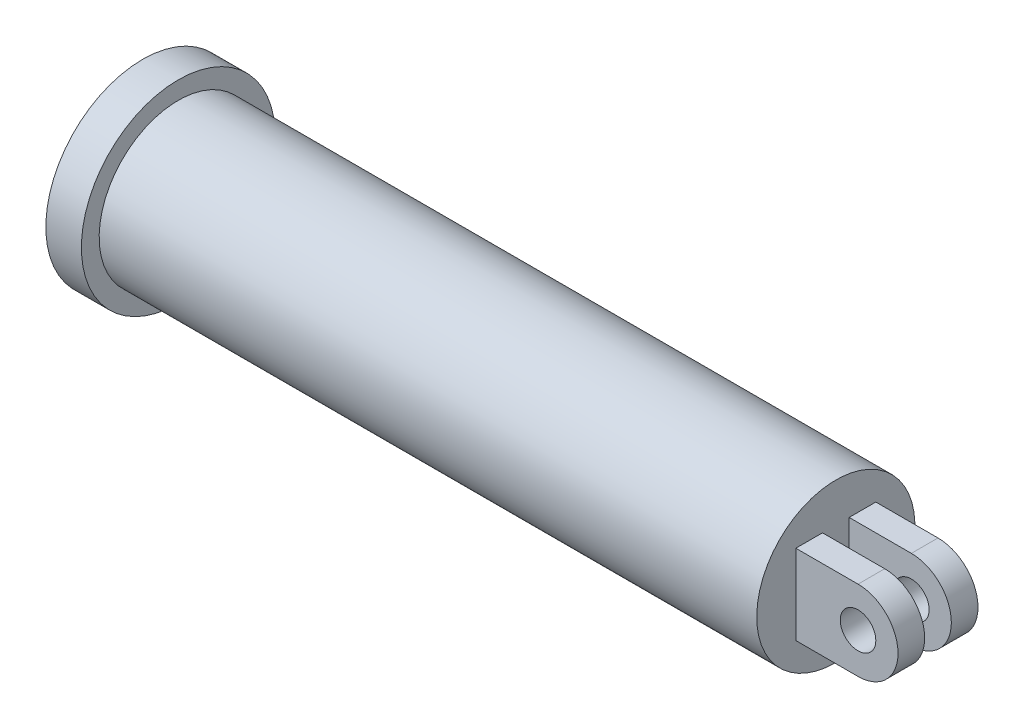
ISO-10303-21;
HEADER;
FILE_DESCRIPTION(('STEP AP214'),'2;1');
FILE_NAME('part.step','',(''),(''),'','','');
FILE_SCHEMA(('AUTOMOTIVE_DESIGN { 1 0 10303 214 1 1 1 1 }'));
ENDSEC;
DATA;
#1=APPLICATION_CONTEXT('core data for automotive mechanical design processes');
#2=APPLICATION_PROTOCOL_DEFINITION('international standard','automotive_design',2000,#1);
#3=PRODUCT_CONTEXT('',#1,'mechanical');
#4=PRODUCT('Part','Part','',(#3));
#5=PRODUCT_RELATED_PRODUCT_CATEGORY('part','',(#4));
#6=PRODUCT_DEFINITION_FORMATION('','',#4);
#7=PRODUCT_DEFINITION_CONTEXT('part definition',#1,'design');
#8=PRODUCT_DEFINITION('design','',#6,#7);
#9=PRODUCT_DEFINITION_SHAPE('','',#8);
#10=(LENGTH_UNIT() NAMED_UNIT(*) SI_UNIT(.MILLI.,.METRE.));
#11=(NAMED_UNIT(*) PLANE_ANGLE_UNIT() SI_UNIT($,.RADIAN.));
#12=(NAMED_UNIT(*) SI_UNIT($,.STERADIAN.) SOLID_ANGLE_UNIT());
#13=UNCERTAINTY_MEASURE_WITH_UNIT(LENGTH_MEASURE(1.E-05),#10,'distance_accuracy_value','');
#14=(GEOMETRIC_REPRESENTATION_CONTEXT(3) GLOBAL_UNCERTAINTY_ASSIGNED_CONTEXT((#13)) GLOBAL_UNIT_ASSIGNED_CONTEXT((#10,
#11,#12)) REPRESENTATION_CONTEXT('',''));
#15=CARTESIAN_POINT('',(0.,0.,0.));
#16=DIRECTION('',(0.,0.,1.));
#17=DIRECTION('',(1.,0.,0.));
#18=AXIS2_PLACEMENT_3D('',#15,#16,#17);
#19=CARTESIAN_POINT('',(195.,0.,0.));
#20=DIRECTION('',(-1.,0.,0.));
#21=DIRECTION('',(0.,-1.,0.));
#22=AXIS2_PLACEMENT_3D('',#19,#20,#21);
#23=PLANE('',#22);
#24=DIRECTION('',(0.,0.,-1.));
#25=VECTOR('',#24,1.);
#26=CARTESIAN_POINT('',(195.,-22.5,22.5));
#27=LINE('',#26,#25);
#28=CARTESIAN_POINT('',(195.,-22.5,22.5));
#29=VERTEX_POINT('',#28);
#30=CARTESIAN_POINT('',(195.,-22.5,7.5));
#31=VERTEX_POINT('',#30);
#32=EDGE_CURVE('E55',#29,#31,#27,.T.);
#33=ORIENTED_EDGE('',*,*,#32,.F.);
#34=DIRECTION('',(0.,-1.,0.));
#35=VECTOR('',#34,1.);
#36=CARTESIAN_POINT('',(195.,22.5,22.5));
#37=LINE('',#36,#35);
#38=CARTESIAN_POINT('',(195.,22.5,22.5));
#39=VERTEX_POINT('',#38);
#40=EDGE_CURVE('E132',#39,#29,#37,.T.);
#41=ORIENTED_EDGE('',*,*,#40,.F.);
#42=DIRECTION('',(0.,0.,-1.));
#43=VECTOR('',#42,1.);
#44=CARTESIAN_POINT('',(195.,22.5,22.5));
#45=LINE('',#44,#43);
#46=CARTESIAN_POINT('',(195.,22.5,7.5));
#47=VERTEX_POINT('',#46);
#48=EDGE_CURVE('E143',#39,#47,#45,.T.);
#49=ORIENTED_EDGE('',*,*,#48,.T.);
#50=DIRECTION('',(0.,-1.,0.));
#51=VECTOR('',#50,1.);
#52=CARTESIAN_POINT('',(195.,22.5,7.5));
#53=LINE('',#52,#51);
#54=EDGE_CURVE('E130',#47,#31,#53,.T.);
#55=ORIENTED_EDGE('',*,*,#54,.T.);
#56=EDGE_LOOP('',(#33,#41,#49,#55));
#57=FACE_BOUND('',#56,.T.);
#58=CARTESIAN_POINT('',(195.,0.,0.));
#59=DIRECTION('',(-1.,0.,0.));
#60=DIRECTION('',(0.,-1.,0.));
#61=AXIS2_PLACEMENT_3D('',#58,#59,#60);
#62=CIRCLE('',#61,44.4999999999999);
#63=CARTESIAN_POINT('',(195.,-44.4999999999999,0.));
#64=VERTEX_POINT('',#63);
#65=EDGE_CURVE('E11',#64,#64,#62,.T.);
#66=ORIENTED_EDGE('',*,*,#65,.F.);
#67=EDGE_LOOP('',(#66));
#68=FACE_BOUND('',#67,.T.);
#69=DIRECTION('',(0.,-1.,0.));
#70=VECTOR('',#69,1.);
#71=CARTESIAN_POINT('',(195.,22.5,-22.5));
#72=LINE('',#71,#70);
#73=CARTESIAN_POINT('',(195.,22.5,-22.5));
#74=VERTEX_POINT('',#73);
#75=CARTESIAN_POINT('',(195.,-22.5,-22.5));
#76=VERTEX_POINT('',#75);
#77=EDGE_CURVE('E99',#74,#76,#72,.T.);
#78=ORIENTED_EDGE('',*,*,#77,.T.);
#79=DIRECTION('',(0.,0.,1.));
#80=VECTOR('',#79,1.);
#81=CARTESIAN_POINT('',(195.,-22.5,-22.5));
#82=LINE('',#81,#80);
#83=CARTESIAN_POINT('',(195.,-22.5,-7.5));
#84=VERTEX_POINT('',#83);
#85=EDGE_CURVE('E246',#76,#84,#82,.T.);
#86=ORIENTED_EDGE('',*,*,#85,.T.);
#87=DIRECTION('',(0.,-1.,0.));
#88=VECTOR('',#87,1.);
#89=CARTESIAN_POINT('',(195.,22.5,-7.5));
#90=LINE('',#89,#88);
#91=CARTESIAN_POINT('',(195.,22.5,-7.5));
#92=VERTEX_POINT('',#91);
#93=EDGE_CURVE('E119',#92,#84,#90,.T.);
#94=ORIENTED_EDGE('',*,*,#93,.F.);
#95=DIRECTION('',(0.,0.,1.));
#96=VECTOR('',#95,1.);
#97=CARTESIAN_POINT('',(195.,22.5,-22.5));
#98=LINE('',#97,#96);
#99=EDGE_CURVE('E114',#74,#92,#98,.T.);
#100=ORIENTED_EDGE('',*,*,#99,.F.);
#101=EDGE_LOOP('',(#78,#86,#94,#100));
#102=FACE_BOUND('',#101,.T.);
#103=ADVANCED_FACE('F32',(#57,#68,#102),#23,.F.);
#104=CARTESIAN_POINT('',(-195.,54.5,0.));
#105=DIRECTION('',(1.,0.,0.));
#106=DIRECTION('',(0.,1.,0.));
#107=AXIS2_PLACEMENT_3D('',#104,#105,#106);
#108=PLANE('',#107);
#109=CARTESIAN_POINT('',(-195.,0.,0.));
#110=DIRECTION('',(-1.,0.,0.));
#111=DIRECTION('',(0.,-1.,0.));
#112=AXIS2_PLACEMENT_3D('',#109,#110,#111);
#113=CIRCLE('',#112,54.5);
#114=CARTESIAN_POINT('',(-195.,-54.5,0.));
#115=VERTEX_POINT('',#114);
#116=EDGE_CURVE('E159',#115,#115,#113,.T.);
#117=ORIENTED_EDGE('',*,*,#116,.T.);
#118=EDGE_LOOP('',(#117));
#119=FACE_BOUND('',#118,.T.);
#120=ADVANCED_FACE('F34',(#119),#108,.F.);
#121=CARTESIAN_POINT('',(-195.,0.,0.));
#122=DIRECTION('',(-1.,0.,0.));
#123=DIRECTION('',(0.,-1.,0.));
#124=AXIS2_PLACEMENT_3D('',#121,#122,#123);
#125=CYLINDRICAL_SURFACE('',#124,44.4999999999999);
#126=CARTESIAN_POINT('',(-175.,0.,0.));
#127=DIRECTION('',(-1.,0.,0.));
#128=DIRECTION('',(0.,-1.,0.));
#129=AXIS2_PLACEMENT_3D('',#126,#127,#128);
#130=CIRCLE('',#129,44.5);
#131=CARTESIAN_POINT('',(-175.,-44.4999999999999,0.));
#132=VERTEX_POINT('',#131);
#133=EDGE_CURVE('E40',#132,#132,#130,.T.);
#134=ORIENTED_EDGE('',*,*,#133,.F.);
#135=EDGE_LOOP('',(#134));
#136=FACE_BOUND('',#135,.T.);
#137=ORIENTED_EDGE('',*,*,#65,.T.);
#138=EDGE_LOOP('',(#137));
#139=FACE_BOUND('',#138,.T.);
#140=ADVANCED_FACE('F169',(#136,#139),#125,.T.);
#141=CARTESIAN_POINT('',(-175.,44.5,0.));
#142=DIRECTION('',(-1.,0.,0.));
#143=DIRECTION('',(0.,-1.,0.));
#144=AXIS2_PLACEMENT_3D('',#141,#142,#143);
#145=PLANE('',#144);
#146=CARTESIAN_POINT('',(-175.,0.,0.));
#147=DIRECTION('',(-1.,0.,0.));
#148=DIRECTION('',(0.,-1.,0.));
#149=AXIS2_PLACEMENT_3D('',#146,#147,#148);
#150=CIRCLE('',#149,54.5);
#151=CARTESIAN_POINT('',(-175.,-54.5,0.));
#152=VERTEX_POINT('',#151);
#153=EDGE_CURVE('E162',#152,#152,#150,.T.);
#154=ORIENTED_EDGE('',*,*,#153,.F.);
#155=EDGE_LOOP('',(#154));
#156=FACE_BOUND('',#155,.T.);
#157=ORIENTED_EDGE('',*,*,#133,.T.);
#158=EDGE_LOOP('',(#157));
#159=FACE_BOUND('',#158,.T.);
#160=ADVANCED_FACE('F167',(#156,#159),#145,.F.);
#161=CARTESIAN_POINT('',(-195.,0.,0.));
#162=DIRECTION('',(-1.,0.,0.));
#163=DIRECTION('',(0.,-1.,0.));
#164=AXIS2_PLACEMENT_3D('',#161,#162,#163);
#165=CYLINDRICAL_SURFACE('',#164,54.5);
#166=ORIENTED_EDGE('',*,*,#116,.F.);
#167=EDGE_LOOP('',(#166));
#168=FACE_BOUND('',#167,.T.);
#169=ORIENTED_EDGE('',*,*,#153,.T.);
#170=EDGE_LOOP('',(#169));
#171=FACE_BOUND('',#170,.T.);
#172=ADVANCED_FACE('F183',(#168,#171),#165,.T.);
#173=CARTESIAN_POINT('',(230.,0.,22.5));
#174=DIRECTION('',(0.,0.,-1.));
#175=DIRECTION('',(-1.,0.,0.));
#176=AXIS2_PLACEMENT_3D('',#173,#174,#175);
#177=PLANE('',#176);
#178=ORIENTED_EDGE('',*,*,#40,.T.);
#179=DIRECTION('',(1.,0.,0.));
#180=VECTOR('',#179,1.);
#181=CARTESIAN_POINT('',(195.,-22.5,22.5));
#182=LINE('',#181,#180);
#183=CARTESIAN_POINT('',(230.,-22.5,22.5));
#184=VERTEX_POINT('',#183);
#185=EDGE_CURVE('E135',#29,#184,#182,.T.);
#186=ORIENTED_EDGE('',*,*,#185,.T.);
#187=CARTESIAN_POINT('',(230.,0.,22.5));
#188=DIRECTION('',(0.,0.,1.));
#189=DIRECTION('',(-1.,0.,0.));
#190=AXIS2_PLACEMENT_3D('',#187,#188,#189);
#191=CIRCLE('',#190,22.5);
#192=CARTESIAN_POINT('',(230.,22.5,22.5));
#193=VERTEX_POINT('',#192);
#194=EDGE_CURVE('E138',#184,#193,#191,.T.);
#195=ORIENTED_EDGE('',*,*,#194,.T.);
#196=DIRECTION('',(-1.,0.,0.));
#197=VECTOR('',#196,1.);
#198=CARTESIAN_POINT('',(195.,22.5,22.5));
#199=LINE('',#198,#197);
#200=EDGE_CURVE('E140',#193,#39,#199,.T.);
#201=ORIENTED_EDGE('',*,*,#200,.T.);
#202=EDGE_LOOP('',(#178,#186,#195,#201));
#203=FACE_BOUND('',#202,.T.);
#204=CARTESIAN_POINT('',(230.,0.,22.5));
#205=DIRECTION('',(0.,0.,1.));
#206=DIRECTION('',(1.,0.,0.));
#207=AXIS2_PLACEMENT_3D('',#204,#205,#206);
#208=CIRCLE('',#207,10.);
#209=CARTESIAN_POINT('',(240.,0.,22.5));
#210=VERTEX_POINT('',#209);
#211=EDGE_CURVE('E123',#210,#210,#208,.T.);
#212=ORIENTED_EDGE('',*,*,#211,.F.);
#213=EDGE_LOOP('',(#212));
#214=FACE_BOUND('',#213,.T.);
#215=ADVANCED_FACE('F187',(#203,#214),#177,.F.);
#216=CARTESIAN_POINT('',(230.,0.,7.5));
#217=DIRECTION('',(0.,0.,-1.));
#218=DIRECTION('',(-1.,0.,0.));
#219=AXIS2_PLACEMENT_3D('',#216,#217,#218);
#220=PLANE('',#219);
#221=ORIENTED_EDGE('',*,*,#54,.F.);
#222=DIRECTION('',(-1.,0.,0.));
#223=VECTOR('',#222,1.);
#224=CARTESIAN_POINT('',(195.,22.5,7.5));
#225=LINE('',#224,#223);
#226=CARTESIAN_POINT('',(230.,22.5,7.5));
#227=VERTEX_POINT('',#226);
#228=EDGE_CURVE('E136',#227,#47,#225,.T.);
#229=ORIENTED_EDGE('',*,*,#228,.F.);
#230=CARTESIAN_POINT('',(230.,0.,7.5));
#231=DIRECTION('',(0.,0.,1.));
#232=DIRECTION('',(-1.,0.,0.));
#233=AXIS2_PLACEMENT_3D('',#230,#231,#232);
#234=CIRCLE('',#233,22.5);
#235=CARTESIAN_POINT('',(230.,-22.5,7.5));
#236=VERTEX_POINT('',#235);
#237=EDGE_CURVE('E147',#236,#227,#234,.T.);
#238=ORIENTED_EDGE('',*,*,#237,.F.);
#239=DIRECTION('',(1.,0.,0.));
#240=VECTOR('',#239,1.);
#241=CARTESIAN_POINT('',(195.,-22.5,7.5));
#242=LINE('',#241,#240);
#243=EDGE_CURVE('E145',#31,#236,#242,.T.);
#244=ORIENTED_EDGE('',*,*,#243,.F.);
#245=EDGE_LOOP('',(#221,#229,#238,#244));
#246=FACE_BOUND('',#245,.T.);
#247=CARTESIAN_POINT('',(230.,0.,7.5));
#248=DIRECTION('',(0.,0.,1.));
#249=DIRECTION('',(1.,0.,0.));
#250=AXIS2_PLACEMENT_3D('',#247,#248,#249);
#251=CIRCLE('',#250,10.);
#252=CARTESIAN_POINT('',(240.,0.,7.5));
#253=VERTEX_POINT('',#252);
#254=EDGE_CURVE('E120',#253,#253,#251,.T.);
#255=ORIENTED_EDGE('',*,*,#254,.T.);
#256=EDGE_LOOP('',(#255));
#257=FACE_BOUND('',#256,.T.);
#258=ADVANCED_FACE('F193',(#246,#257),#220,.T.);
#259=CARTESIAN_POINT('',(195.,-22.5,22.5));
#260=DIRECTION('',(0.,1.,0.));
#261=DIRECTION('',(-1.,0.,0.));
#262=AXIS2_PLACEMENT_3D('',#259,#260,#261);
#263=PLANE('',#262);
#264=ORIENTED_EDGE('',*,*,#243,.T.);
#265=DIRECTION('',(0.,0.,-1.));
#266=VECTOR('',#265,1.);
#267=CARTESIAN_POINT('',(230.,-22.5,22.5));
#268=LINE('',#267,#266);
#269=EDGE_CURVE('E155',#184,#236,#268,.T.);
#270=ORIENTED_EDGE('',*,*,#269,.F.);
#271=ORIENTED_EDGE('',*,*,#185,.F.);
#272=ORIENTED_EDGE('',*,*,#32,.T.);
#273=EDGE_LOOP('',(#264,#270,#271,#272));
#274=FACE_BOUND('',#273,.T.);
#275=ADVANCED_FACE('F189',(#274),#263,.F.);
#276=CARTESIAN_POINT('',(230.,0.,22.5));
#277=DIRECTION('',(0.,0.,-1.));
#278=DIRECTION('',(-1.,0.,0.));
#279=AXIS2_PLACEMENT_3D('',#276,#277,#278);
#280=CYLINDRICAL_SURFACE('',#279,22.5);
#281=ORIENTED_EDGE('',*,*,#237,.T.);
#282=DIRECTION('',(0.,0.,-1.));
#283=VECTOR('',#282,1.);
#284=CARTESIAN_POINT('',(230.,22.5,22.5));
#285=LINE('',#284,#283);
#286=EDGE_CURVE('E152',#193,#227,#285,.T.);
#287=ORIENTED_EDGE('',*,*,#286,.F.);
#288=ORIENTED_EDGE('',*,*,#194,.F.);
#289=ORIENTED_EDGE('',*,*,#269,.T.);
#290=EDGE_LOOP('',(#281,#287,#288,#289));
#291=FACE_BOUND('',#290,.T.);
#292=ADVANCED_FACE('F192',(#291),#280,.T.);
#293=CARTESIAN_POINT('',(195.,22.5,22.5));
#294=DIRECTION('',(0.,-1.,0.));
#295=DIRECTION('',(1.,0.,0.));
#296=AXIS2_PLACEMENT_3D('',#293,#294,#295);
#297=PLANE('',#296);
#298=ORIENTED_EDGE('',*,*,#228,.T.);
#299=ORIENTED_EDGE('',*,*,#48,.F.);
#300=ORIENTED_EDGE('',*,*,#200,.F.);
#301=ORIENTED_EDGE('',*,*,#286,.T.);
#302=EDGE_LOOP('',(#298,#299,#300,#301));
#303=FACE_BOUND('',#302,.T.);
#304=ADVANCED_FACE('F197',(#303),#297,.F.);
#305=CARTESIAN_POINT('',(230.,0.,22.5));
#306=DIRECTION('',(0.,0.,-1.));
#307=DIRECTION('',(-1.,0.,0.));
#308=AXIS2_PLACEMENT_3D('',#305,#306,#307);
#309=CYLINDRICAL_SURFACE('',#308,10.);
#310=ORIENTED_EDGE('',*,*,#211,.T.);
#311=EDGE_LOOP('',(#310));
#312=FACE_BOUND('',#311,.T.);
#313=ORIENTED_EDGE('',*,*,#254,.F.);
#314=EDGE_LOOP('',(#313));
#315=FACE_BOUND('',#314,.T.);
#316=ADVANCED_FACE('F201',(#312,#315),#309,.F.);
#317=CARTESIAN_POINT('',(195.,22.5,-22.5));
#318=DIRECTION('',(0.,1.,0.));
#319=DIRECTION('',(-1.,0.,0.));
#320=AXIS2_PLACEMENT_3D('',#317,#318,#319);
#321=PLANE('',#320);
#322=DIRECTION('',(-1.,0.,0.));
#323=VECTOR('',#322,1.);
#324=CARTESIAN_POINT('',(195.,22.5,-7.5));
#325=LINE('',#324,#323);
#326=CARTESIAN_POINT('',(230.,22.5,-7.5));
#327=VERTEX_POINT('',#326);
#328=EDGE_CURVE('E47',#327,#92,#325,.T.);
#329=ORIENTED_EDGE('',*,*,#328,.F.);
#330=DIRECTION('',(0.,0.,1.));
#331=VECTOR('',#330,1.);
#332=CARTESIAN_POINT('',(230.,22.5,-22.5));
#333=LINE('',#332,#331);
#334=CARTESIAN_POINT('',(230.,22.5,-22.5));
#335=VERTEX_POINT('',#334);
#336=EDGE_CURVE('E116',#335,#327,#333,.T.);
#337=ORIENTED_EDGE('',*,*,#336,.F.);
#338=DIRECTION('',(-1.,0.,0.));
#339=VECTOR('',#338,1.);
#340=CARTESIAN_POINT('',(195.,22.5,-22.5));
#341=LINE('',#340,#339);
#342=EDGE_CURVE('E103',#335,#74,#341,.T.);
#343=ORIENTED_EDGE('',*,*,#342,.T.);
#344=ORIENTED_EDGE('',*,*,#99,.T.);
#345=EDGE_LOOP('',(#329,#337,#343,#344));
#346=FACE_BOUND('',#345,.T.);
#347=ADVANCED_FACE('F113',(#346),#321,.T.);
#348=CARTESIAN_POINT('',(230.,0.,-22.5));
#349=DIRECTION('',(0.,0.,1.));
#350=DIRECTION('',(1.,0.,0.));
#351=AXIS2_PLACEMENT_3D('',#348,#349,#350);
#352=CYLINDRICAL_SURFACE('',#351,22.5);
#353=CARTESIAN_POINT('',(230.,0.,-7.5));
#354=DIRECTION('',(0.,0.,1.));
#355=DIRECTION('',(-1.,0.,0.));
#356=AXIS2_PLACEMENT_3D('',#353,#354,#355);
#357=CIRCLE('',#356,22.5);
#358=CARTESIAN_POINT('',(230.,-22.5,-7.5));
#359=VERTEX_POINT('',#358);
#360=EDGE_CURVE('E249',#359,#327,#357,.T.);
#361=ORIENTED_EDGE('',*,*,#360,.F.);
#362=DIRECTION('',(0.,0.,1.));
#363=VECTOR('',#362,1.);
#364=CARTESIAN_POINT('',(230.,-22.5,-22.5));
#365=LINE('',#364,#363);
#366=CARTESIAN_POINT('',(230.,-22.5,-22.5));
#367=VERTEX_POINT('',#366);
#368=EDGE_CURVE('E125',#367,#359,#365,.T.);
#369=ORIENTED_EDGE('',*,*,#368,.F.);
#370=CARTESIAN_POINT('',(230.,0.,-22.5));
#371=DIRECTION('',(0.,0.,1.));
#372=DIRECTION('',(-1.,0.,0.));
#373=AXIS2_PLACEMENT_3D('',#370,#371,#372);
#374=CIRCLE('',#373,22.5);
#375=EDGE_CURVE('E117',#367,#335,#374,.T.);
#376=ORIENTED_EDGE('',*,*,#375,.T.);
#377=ORIENTED_EDGE('',*,*,#336,.T.);
#378=EDGE_LOOP('',(#361,#369,#376,#377));
#379=FACE_BOUND('',#378,.T.);
#380=ADVANCED_FACE('F214',(#379),#352,.T.);
#381=CARTESIAN_POINT('',(195.,-22.5,-22.5));
#382=DIRECTION('',(0.,-1.,0.));
#383=DIRECTION('',(1.,0.,0.));
#384=AXIS2_PLACEMENT_3D('',#381,#382,#383);
#385=PLANE('',#384);
#386=DIRECTION('',(1.,0.,0.));
#387=VECTOR('',#386,1.);
#388=CARTESIAN_POINT('',(195.,-22.5,-7.5));
#389=LINE('',#388,#387);
#390=EDGE_CURVE('E110',#84,#359,#389,.T.);
#391=ORIENTED_EDGE('',*,*,#390,.F.);
#392=ORIENTED_EDGE('',*,*,#85,.F.);
#393=DIRECTION('',(1.,0.,0.));
#394=VECTOR('',#393,1.);
#395=CARTESIAN_POINT('',(195.,-22.5,-22.5));
#396=LINE('',#395,#394);
#397=EDGE_CURVE('E106',#76,#367,#396,.T.);
#398=ORIENTED_EDGE('',*,*,#397,.T.);
#399=ORIENTED_EDGE('',*,*,#368,.T.);
#400=EDGE_LOOP('',(#391,#392,#398,#399));
#401=FACE_BOUND('',#400,.T.);
#402=ADVANCED_FACE('F217',(#401),#385,.T.);
#403=CARTESIAN_POINT('',(230.,0.,-22.5));
#404=DIRECTION('',(0.,0.,1.));
#405=DIRECTION('',(-1.,0.,0.));
#406=AXIS2_PLACEMENT_3D('',#403,#404,#405);
#407=PLANE('',#406);
#408=CARTESIAN_POINT('',(230.,0.,-22.5));
#409=DIRECTION('',(0.,0.,1.));
#410=DIRECTION('',(1.,0.,0.));
#411=AXIS2_PLACEMENT_3D('',#408,#409,#410);
#412=CIRCLE('',#411,10.);
#413=CARTESIAN_POINT('',(240.,0.,-22.5));
#414=VERTEX_POINT('',#413);
#415=EDGE_CURVE('E237',#414,#414,#412,.T.);
#416=ORIENTED_EDGE('',*,*,#415,.T.);
#417=EDGE_LOOP('',(#416));
#418=FACE_BOUND('',#417,.T.);
#419=ORIENTED_EDGE('',*,*,#77,.F.);
#420=ORIENTED_EDGE('',*,*,#342,.F.);
#421=ORIENTED_EDGE('',*,*,#375,.F.);
#422=ORIENTED_EDGE('',*,*,#397,.F.);
#423=EDGE_LOOP('',(#419,#420,#421,#422));
#424=FACE_BOUND('',#423,.T.);
#425=ADVANCED_FACE('F101',(#418,#424),#407,.F.);
#426=CARTESIAN_POINT('',(230.,0.,-7.5));
#427=DIRECTION('',(0.,0.,1.));
#428=DIRECTION('',(-1.,0.,0.));
#429=AXIS2_PLACEMENT_3D('',#426,#427,#428);
#430=PLANE('',#429);
#431=CARTESIAN_POINT('',(230.,0.,-7.5));
#432=DIRECTION('',(0.,0.,1.));
#433=DIRECTION('',(1.,0.,0.));
#434=AXIS2_PLACEMENT_3D('',#431,#432,#433);
#435=CIRCLE('',#434,10.);
#436=CARTESIAN_POINT('',(240.,0.,-7.5));
#437=VERTEX_POINT('',#436);
#438=EDGE_CURVE('E240',#437,#437,#435,.T.);
#439=ORIENTED_EDGE('',*,*,#438,.F.);
#440=EDGE_LOOP('',(#439));
#441=FACE_BOUND('',#440,.T.);
#442=ORIENTED_EDGE('',*,*,#93,.T.);
#443=ORIENTED_EDGE('',*,*,#390,.T.);
#444=ORIENTED_EDGE('',*,*,#360,.T.);
#445=ORIENTED_EDGE('',*,*,#328,.T.);
#446=EDGE_LOOP('',(#442,#443,#444,#445));
#447=FACE_BOUND('',#446,.T.);
#448=ADVANCED_FACE('F222',(#441,#447),#430,.T.);
#449=CARTESIAN_POINT('',(230.,0.,-22.5));
#450=DIRECTION('',(0.,0.,1.));
#451=DIRECTION('',(1.,0.,0.));
#452=AXIS2_PLACEMENT_3D('',#449,#450,#451);
#453=CYLINDRICAL_SURFACE('',#452,10.);
#454=ORIENTED_EDGE('',*,*,#415,.F.);
#455=EDGE_LOOP('',(#454));
#456=FACE_BOUND('',#455,.T.);
#457=ORIENTED_EDGE('',*,*,#438,.T.);
#458=EDGE_LOOP('',(#457));
#459=FACE_BOUND('',#458,.T.);
#460=ADVANCED_FACE('F225',(#456,#459),#453,.F.);
#461=CLOSED_SHELL('',(#103,#120,#140,#160,#172,#215,#258,#275,#292,#304,#316,#347,#380,#402,
#425,#448,#460));
#462=MANIFOLD_SOLID_BREP('B2',#461);
#463=ADVANCED_BREP_SHAPE_REPRESENTATION('',(#18,#462),#14);
#464=SHAPE_DEFINITION_REPRESENTATION(#9,#463);
ENDSEC;
END-ISO-10303-21;
